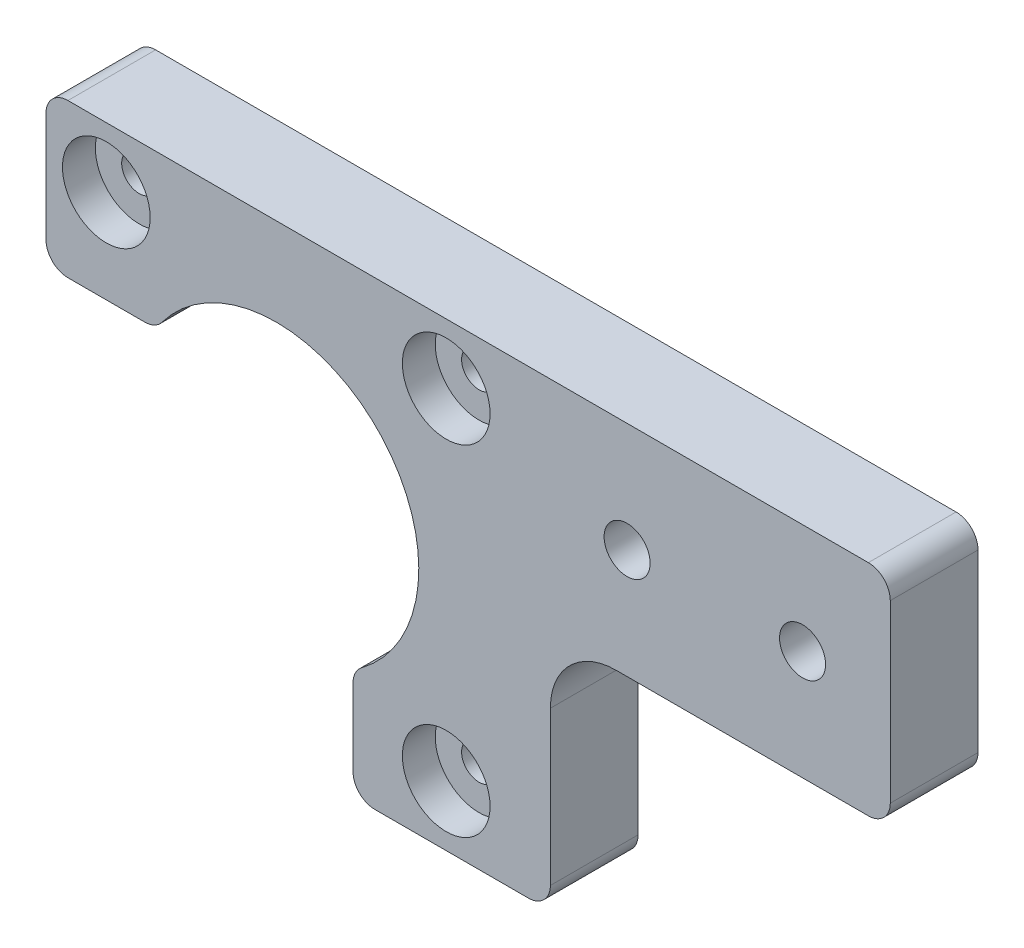
ISO-10303-21;
HEADER;
FILE_DESCRIPTION(('STEP AP214'),'2;1');
FILE_NAME('part.step','',(''),(''),'','','');
FILE_SCHEMA(('AUTOMOTIVE_DESIGN { 1 0 10303 214 1 1 1 1 }'));
ENDSEC;
DATA;
#1=APPLICATION_CONTEXT('core data for automotive mechanical design processes');
#2=APPLICATION_PROTOCOL_DEFINITION('international standard','automotive_design',2000,#1);
#3=PRODUCT_CONTEXT('',#1,'mechanical');
#4=PRODUCT('Part','Part','',(#3));
#5=PRODUCT_RELATED_PRODUCT_CATEGORY('part','',(#4));
#6=PRODUCT_DEFINITION_FORMATION('','',#4);
#7=PRODUCT_DEFINITION_CONTEXT('part definition',#1,'design');
#8=PRODUCT_DEFINITION('design','',#6,#7);
#9=PRODUCT_DEFINITION_SHAPE('','',#8);
#10=(LENGTH_UNIT() NAMED_UNIT(*) SI_UNIT(.MILLI.,.METRE.));
#11=(NAMED_UNIT(*) PLANE_ANGLE_UNIT() SI_UNIT($,.RADIAN.));
#12=(NAMED_UNIT(*) SI_UNIT($,.STERADIAN.) SOLID_ANGLE_UNIT());
#13=UNCERTAINTY_MEASURE_WITH_UNIT(LENGTH_MEASURE(1.E-05),#10,'distance_accuracy_value','');
#14=(GEOMETRIC_REPRESENTATION_CONTEXT(3) GLOBAL_UNCERTAINTY_ASSIGNED_CONTEXT((#13)) GLOBAL_UNIT_ASSIGNED_CONTEXT((#10,
#11,#12)) REPRESENTATION_CONTEXT('',''));
#15=CARTESIAN_POINT('',(0.,0.,0.));
#16=DIRECTION('',(0.,0.,1.));
#17=DIRECTION('',(1.,0.,0.));
#18=AXIS2_PLACEMENT_3D('',#15,#16,#17);
#19=CARTESIAN_POINT('',(0.,0.,8.));
#20=DIRECTION('',(1.,0.,0.));
#21=DIRECTION('',(0.,0.,-1.));
#22=AXIS2_PLACEMENT_3D('',#19,#20,#21);
#23=PLANE('',#22);
#24=DIRECTION('',(0.,-1.,0.));
#25=VECTOR('',#24,1.);
#26=CARTESIAN_POINT('',(0.,0.,8.));
#27=LINE('',#26,#25);
#28=CARTESIAN_POINT('',(0.,40.,8.));
#29=VERTEX_POINT('',#28);
#30=CARTESIAN_POINT('',(0.,30.,8.));
#31=VERTEX_POINT('',#30);
#32=EDGE_CURVE('E249',#29,#31,#27,.T.);
#33=ORIENTED_EDGE('',*,*,#32,.F.);
#34=DIRECTION('',(0.,0.,-1.));
#35=VECTOR('',#34,1.);
#36=CARTESIAN_POINT('',(0.,40.,8.));
#37=LINE('',#36,#35);
#38=CARTESIAN_POINT('',(0.,40.,0.));
#39=VERTEX_POINT('',#38);
#40=EDGE_CURVE('E315',#29,#39,#37,.T.);
#41=ORIENTED_EDGE('',*,*,#40,.T.);
#42=DIRECTION('',(0.,-1.,0.));
#43=VECTOR('',#42,1.);
#44=CARTESIAN_POINT('',(0.,0.,0.));
#45=LINE('',#44,#43);
#46=CARTESIAN_POINT('',(0.,30.,0.));
#47=VERTEX_POINT('',#46);
#48=EDGE_CURVE('E246',#39,#47,#45,.T.);
#49=ORIENTED_EDGE('',*,*,#48,.T.);
#50=DIRECTION('',(0.,0.,1.));
#51=VECTOR('',#50,1.);
#52=CARTESIAN_POINT('',(0.,30.,8.));
#53=LINE('',#52,#51);
#54=EDGE_CURVE('E312',#47,#31,#53,.T.);
#55=ORIENTED_EDGE('',*,*,#54,.T.);
#56=EDGE_LOOP('',(#33,#41,#49,#55));
#57=FACE_BOUND('',#56,.T.);
#58=ADVANCED_FACE('F33',(#57),#23,.F.);
#59=CARTESIAN_POINT('',(0.,0.,8.));
#60=DIRECTION('',(0.,1.,0.));
#61=DIRECTION('',(0.,0.,1.));
#62=AXIS2_PLACEMENT_3D('',#59,#60,#61);
#63=PLANE('',#62);
#64=DIRECTION('',(1.,0.,0.));
#65=VECTOR('',#64,1.);
#66=CARTESIAN_POINT('',(0.,0.,8.));
#67=LINE('',#66,#65);
#68=CARTESIAN_POINT('',(30.,0.,8.));
#69=VERTEX_POINT('',#68);
#70=CARTESIAN_POINT('',(43.9999999999994,0.,8.));
#71=VERTEX_POINT('',#70);
#72=EDGE_CURVE('E252',#69,#71,#67,.T.);
#73=ORIENTED_EDGE('',*,*,#72,.F.);
#74=DIRECTION('',(0.,0.,1.));
#75=VECTOR('',#74,1.);
#76=CARTESIAN_POINT('',(30.,0.,8.));
#77=LINE('',#76,#75);
#78=CARTESIAN_POINT('',(30.,0.,0.));
#79=VERTEX_POINT('',#78);
#80=EDGE_CURVE('E41',#69,#79,#77,.F.);
#81=ORIENTED_EDGE('',*,*,#80,.T.);
#82=DIRECTION('',(1.,0.,0.));
#83=VECTOR('',#82,1.);
#84=CARTESIAN_POINT('',(0.,0.,0.));
#85=LINE('',#84,#83);
#86=CARTESIAN_POINT('',(43.9999999999994,0.,0.));
#87=VERTEX_POINT('',#86);
#88=EDGE_CURVE('E262',#79,#87,#85,.T.);
#89=ORIENTED_EDGE('',*,*,#88,.T.);
#90=DIRECTION('',(0.,0.,1.));
#91=VECTOR('',#90,1.);
#92=CARTESIAN_POINT('',(43.9999999999994,0.,8.));
#93=LINE('',#92,#91);
#94=EDGE_CURVE('E333',#87,#71,#93,.T.);
#95=ORIENTED_EDGE('',*,*,#94,.T.);
#96=EDGE_LOOP('',(#73,#81,#89,#95));
#97=FACE_BOUND('',#96,.T.);
#98=ADVANCED_FACE('F339',(#97),#63,.F.);
#99=CARTESIAN_POINT('',(77.,0.,8.));
#100=DIRECTION('',(-1.,0.,0.));
#101=DIRECTION('',(0.,0.,1.));
#102=AXIS2_PLACEMENT_3D('',#99,#100,#101);
#103=PLANE('',#102);
#104=DIRECTION('',(0.,1.,0.));
#105=VECTOR('',#104,1.);
#106=CARTESIAN_POINT('',(77.,0.,0.));
#107=LINE('',#106,#105);
#108=CARTESIAN_POINT('',(77.,24.,0.));
#109=VERTEX_POINT('',#108);
#110=CARTESIAN_POINT('',(77.,40.,0.));
#111=VERTEX_POINT('',#110);
#112=EDGE_CURVE('E265',#109,#111,#107,.T.);
#113=ORIENTED_EDGE('',*,*,#112,.T.);
#114=DIRECTION('',(0.,0.,-1.));
#115=VECTOR('',#114,1.);
#116=CARTESIAN_POINT('',(77.,40.,8.));
#117=LINE('',#116,#115);
#118=CARTESIAN_POINT('',(77.,40.,8.));
#119=VERTEX_POINT('',#118);
#120=EDGE_CURVE('E324',#111,#119,#117,.F.);
#121=ORIENTED_EDGE('',*,*,#120,.T.);
#122=DIRECTION('',(0.,1.,0.));
#123=VECTOR('',#122,1.);
#124=CARTESIAN_POINT('',(77.,0.,8.));
#125=LINE('',#124,#123);
#126=CARTESIAN_POINT('',(77.,24.,8.));
#127=VERTEX_POINT('',#126);
#128=EDGE_CURVE('E255',#127,#119,#125,.T.);
#129=ORIENTED_EDGE('',*,*,#128,.F.);
#130=DIRECTION('',(0.,0.,1.));
#131=VECTOR('',#130,1.);
#132=CARTESIAN_POINT('',(77.,24.,8.));
#133=LINE('',#132,#131);
#134=EDGE_CURVE('E55',#127,#109,#133,.F.);
#135=ORIENTED_EDGE('',*,*,#134,.T.);
#136=EDGE_LOOP('',(#113,#121,#129,#135));
#137=FACE_BOUND('',#136,.T.);
#138=ADVANCED_FACE('F390',(#137),#103,.F.);
#139=CARTESIAN_POINT('',(0.,42.,8.));
#140=DIRECTION('',(0.,-1.,0.));
#141=DIRECTION('',(0.,0.,-1.));
#142=AXIS2_PLACEMENT_3D('',#139,#140,#141);
#143=PLANE('',#142);
#144=DIRECTION('',(-1.,0.,0.));
#145=VECTOR('',#144,1.);
#146=CARTESIAN_POINT('',(0.,42.,0.));
#147=LINE('',#146,#145);
#148=CARTESIAN_POINT('',(75.,42.,0.));
#149=VERTEX_POINT('',#148);
#150=CARTESIAN_POINT('',(2.,42.,0.));
#151=VERTEX_POINT('',#150);
#152=EDGE_CURVE('E253',#149,#151,#147,.T.);
#153=ORIENTED_EDGE('',*,*,#152,.T.);
#154=DIRECTION('',(0.,0.,-1.));
#155=VECTOR('',#154,1.);
#156=CARTESIAN_POINT('',(2.,42.,8.));
#157=LINE('',#156,#155);
#158=CARTESIAN_POINT('',(2.,42.,8.));
#159=VERTEX_POINT('',#158);
#160=EDGE_CURVE('E321',#151,#159,#157,.F.);
#161=ORIENTED_EDGE('',*,*,#160,.T.);
#162=DIRECTION('',(-1.,0.,0.));
#163=VECTOR('',#162,1.);
#164=CARTESIAN_POINT('',(0.,42.,8.));
#165=LINE('',#164,#163);
#166=CARTESIAN_POINT('',(75.,42.,8.));
#167=VERTEX_POINT('',#166);
#168=EDGE_CURVE('E179',#167,#159,#165,.T.);
#169=ORIENTED_EDGE('',*,*,#168,.F.);
#170=DIRECTION('',(0.,0.,-1.));
#171=VECTOR('',#170,1.);
#172=CARTESIAN_POINT('',(75.,42.,8.));
#173=LINE('',#172,#171);
#174=EDGE_CURVE('E318',#167,#149,#173,.T.);
#175=ORIENTED_EDGE('',*,*,#174,.T.);
#176=EDGE_LOOP('',(#153,#161,#169,#175));
#177=FACE_BOUND('',#176,.T.);
#178=ADVANCED_FACE('F383',(#177),#143,.F.);
#179=CARTESIAN_POINT('',(0.,0.,8.));
#180=DIRECTION('',(0.,0.,-1.));
#181=DIRECTION('',(-1.,0.,0.));
#182=AXIS2_PLACEMENT_3D('',#179,#180,#181);
#183=PLANE('',#182);
#184=CARTESIAN_POINT('',(68.9999999999999,32.,8.));
#185=DIRECTION('',(0.,0.,1.));
#186=DIRECTION('',(1.,0.,0.));
#187=AXIS2_PLACEMENT_3D('',#184,#185,#186);
#188=CIRCLE('',#187,2.10000000000082);
#189=CARTESIAN_POINT('',(71.1000000000008,32.,8.));
#190=VERTEX_POINT('',#189);
#191=EDGE_CURVE('E672',#190,#190,#188,.T.);
#192=ORIENTED_EDGE('',*,*,#191,.F.);
#193=EDGE_LOOP('',(#192));
#194=FACE_BOUND('',#193,.T.);
#195=CARTESIAN_POINT('',(52.9999999999999,32.,8.));
#196=DIRECTION('',(0.,0.,1.));
#197=DIRECTION('',(1.,0.,0.));
#198=AXIS2_PLACEMENT_3D('',#195,#196,#197);
#199=CIRCLE('',#198,2.09999999999897);
#200=CARTESIAN_POINT('',(55.0999999999989,32.,8.));
#201=VERTEX_POINT('',#200);
#202=EDGE_CURVE('E675',#201,#201,#199,.T.);
#203=ORIENTED_EDGE('',*,*,#202,.F.);
#204=EDGE_LOOP('',(#203));
#205=FACE_BOUND('',#204,.T.);
#206=CARTESIAN_POINT('',(21.0000000000008,21.,8.));
#207=DIRECTION('',(0.,0.,1.));
#208=DIRECTION('',(1.,0.,0.));
#209=AXIS2_PLACEMENT_3D('',#206,#207,#208);
#210=CIRCLE('',#209,12.9999999999971);
#211=CARTESIAN_POINT('',(28.7999999999999,10.6000000000029,8.));
#212=VERTEX_POINT('',#211);
#213=CARTESIAN_POINT('',(10.6000000000042,28.7999999999998,8.));
#214=VERTEX_POINT('',#213);
#215=EDGE_CURVE('E220',#212,#214,#210,.T.);
#216=ORIENTED_EDGE('',*,*,#215,.F.);
#217=CARTESIAN_POINT('',(30.,9.00000000000301,8.));
#218=DIRECTION('',(0.,0.,-1.));
#219=DIRECTION('',(-1.,0.,0.));
#220=AXIS2_PLACEMENT_3D('',#217,#218,#219);
#221=CIRCLE('',#220,2.);
#222=CARTESIAN_POINT('',(28.,9.00000000000301,8.));
#223=VERTEX_POINT('',#222);
#224=EDGE_CURVE('E290',#212,#223,#221,.F.);
#225=ORIENTED_EDGE('',*,*,#224,.T.);
#226=DIRECTION('',(0.,1.,0.));
#227=VECTOR('',#226,1.);
#228=CARTESIAN_POINT('',(28.,0.,8.));
#229=LINE('',#228,#227);
#230=CARTESIAN_POINT('',(28.,2.,8.));
#231=VERTEX_POINT('',#230);
#232=EDGE_CURVE('E210',#231,#223,#229,.T.);
#233=ORIENTED_EDGE('',*,*,#232,.F.);
#234=CARTESIAN_POINT('',(30.,2.,8.));
#235=DIRECTION('',(0.,0.,-1.));
#236=DIRECTION('',(-1.,0.,0.));
#237=AXIS2_PLACEMENT_3D('',#234,#235,#236);
#238=CIRCLE('',#237,2.);
#239=EDGE_CURVE('E278',#231,#69,#238,.F.);
#240=ORIENTED_EDGE('',*,*,#239,.T.);
#241=ORIENTED_EDGE('',*,*,#72,.T.);
#242=CARTESIAN_POINT('',(43.9999999999994,2.,8.));
#243=DIRECTION('',(0.,0.,-1.));
#244=DIRECTION('',(-1.,0.,0.));
#245=AXIS2_PLACEMENT_3D('',#242,#243,#244);
#246=CIRCLE('',#245,2.);
#247=CARTESIAN_POINT('',(45.9999999999994,2.,8.));
#248=VERTEX_POINT('',#247);
#249=EDGE_CURVE('E185',#71,#248,#246,.F.);
#250=ORIENTED_EDGE('',*,*,#249,.T.);
#251=DIRECTION('',(0.,-1.,0.));
#252=VECTOR('',#251,1.);
#253=CARTESIAN_POINT('',(45.9999999999994,0.,8.));
#254=LINE('',#253,#252);
#255=CARTESIAN_POINT('',(45.9999999999994,16.,8.));
#256=VERTEX_POINT('',#255);
#257=EDGE_CURVE('E175',#256,#248,#254,.T.);
#258=ORIENTED_EDGE('',*,*,#257,.F.);
#259=CARTESIAN_POINT('',(51.9999999999994,16.,8.));
#260=DIRECTION('',(0.,0.,-1.));
#261=DIRECTION('',(-1.,0.,0.));
#262=AXIS2_PLACEMENT_3D('',#259,#260,#261);
#263=CIRCLE('',#262,6.);
#264=CARTESIAN_POINT('',(51.9999999999994,22.,8.));
#265=VERTEX_POINT('',#264);
#266=EDGE_CURVE('E159',#256,#265,#263,.T.);
#267=ORIENTED_EDGE('',*,*,#266,.T.);
#268=DIRECTION('',(-1.,0.,0.));
#269=VECTOR('',#268,1.);
#270=CARTESIAN_POINT('',(77.,22.,8.));
#271=LINE('',#270,#269);
#272=CARTESIAN_POINT('',(75.,22.,8.));
#273=VERTEX_POINT('',#272);
#274=EDGE_CURVE('E187',#273,#265,#271,.T.);
#275=ORIENTED_EDGE('',*,*,#274,.F.);
#276=CARTESIAN_POINT('',(75.,24.,8.));
#277=DIRECTION('',(0.,0.,-1.));
#278=DIRECTION('',(-1.,0.,0.));
#279=AXIS2_PLACEMENT_3D('',#276,#277,#278);
#280=CIRCLE('',#279,2.);
#281=EDGE_CURVE('E284',#273,#127,#280,.F.);
#282=ORIENTED_EDGE('',*,*,#281,.T.);
#283=ORIENTED_EDGE('',*,*,#128,.T.);
#284=CARTESIAN_POINT('',(75.,40.,8.));
#285=DIRECTION('',(0.,0.,-1.));
#286=DIRECTION('',(-1.,0.,0.));
#287=AXIS2_PLACEMENT_3D('',#284,#285,#286);
#288=CIRCLE('',#287,2.);
#289=EDGE_CURVE('E286',#119,#167,#288,.F.);
#290=ORIENTED_EDGE('',*,*,#289,.T.);
#291=ORIENTED_EDGE('',*,*,#168,.T.);
#292=CARTESIAN_POINT('',(2.,40.,8.));
#293=DIRECTION('',(0.,0.,-1.));
#294=DIRECTION('',(-1.,0.,0.));
#295=AXIS2_PLACEMENT_3D('',#292,#293,#294);
#296=CIRCLE('',#295,2.);
#297=EDGE_CURVE('E288',#159,#29,#296,.F.);
#298=ORIENTED_EDGE('',*,*,#297,.T.);
#299=ORIENTED_EDGE('',*,*,#32,.T.);
#300=CARTESIAN_POINT('',(2.,30.,8.));
#301=DIRECTION('',(0.,0.,-1.));
#302=DIRECTION('',(-1.,0.,0.));
#303=AXIS2_PLACEMENT_3D('',#300,#301,#302);
#304=CIRCLE('',#303,2.);
#305=CARTESIAN_POINT('',(2.,28.,8.));
#306=VERTEX_POINT('',#305);
#307=EDGE_CURVE('E280',#31,#306,#304,.F.);
#308=ORIENTED_EDGE('',*,*,#307,.T.);
#309=DIRECTION('',(-1.,0.,0.));
#310=VECTOR('',#309,1.);
#311=CARTESIAN_POINT('',(0.,28.,8.));
#312=LINE('',#311,#310);
#313=CARTESIAN_POINT('',(9.0000000000044,28.,8.));
#314=VERTEX_POINT('',#313);
#315=EDGE_CURVE('E217',#314,#306,#312,.T.);
#316=ORIENTED_EDGE('',*,*,#315,.F.);
#317=CARTESIAN_POINT('',(9.0000000000044,30.,8.));
#318=DIRECTION('',(0.,0.,-1.));
#319=DIRECTION('',(-1.,0.,0.));
#320=AXIS2_PLACEMENT_3D('',#317,#318,#319);
#321=CIRCLE('',#320,2.);
#322=EDGE_CURVE('E282',#314,#214,#321,.F.);
#323=ORIENTED_EDGE('',*,*,#322,.T.);
#324=EDGE_LOOP('',(#216,#225,#233,#240,#241,#250,#258,#267,#275,#282,#283,#290,#291,#298,#299,
#308,#316,#323));
#325=FACE_BOUND('',#324,.T.);
#326=CARTESIAN_POINT('',(36.5,5.5,8.));
#327=DIRECTION('',(0.,0.,1.));
#328=DIRECTION('',(1.,0.,0.));
#329=AXIS2_PLACEMENT_3D('',#326,#327,#328);
#330=CIRCLE('',#329,4.00000000000359);
#331=CARTESIAN_POINT('',(40.5000000000036,5.5,8.));
#332=VERTEX_POINT('',#331);
#333=EDGE_CURVE('E228',#332,#332,#330,.T.);
#334=ORIENTED_EDGE('',*,*,#333,.F.);
#335=EDGE_LOOP('',(#334));
#336=FACE_BOUND('',#335,.T.);
#337=CARTESIAN_POINT('',(36.5,36.5,8.));
#338=DIRECTION('',(0.,0.,1.));
#339=DIRECTION('',(1.,0.,0.));
#340=AXIS2_PLACEMENT_3D('',#337,#338,#339);
#341=CIRCLE('',#340,4.0000000000036);
#342=CARTESIAN_POINT('',(40.5000000000036,36.5,8.));
#343=VERTEX_POINT('',#342);
#344=EDGE_CURVE('E234',#343,#343,#341,.T.);
#345=ORIENTED_EDGE('',*,*,#344,.F.);
#346=EDGE_LOOP('',(#345));
#347=FACE_BOUND('',#346,.T.);
#348=CARTESIAN_POINT('',(5.49999999999962,36.5,8.));
#349=DIRECTION('',(0.,0.,1.));
#350=DIRECTION('',(1.,0.,0.));
#351=AXIS2_PLACEMENT_3D('',#348,#349,#350);
#352=CIRCLE('',#351,3.99999999999932);
#353=CARTESIAN_POINT('',(9.49999999999894,36.5,8.));
#354=VERTEX_POINT('',#353);
#355=EDGE_CURVE('E240',#354,#354,#352,.T.);
#356=ORIENTED_EDGE('',*,*,#355,.F.);
#357=EDGE_LOOP('',(#356));
#358=FACE_BOUND('',#357,.T.);
#359=ADVANCED_FACE('F182',(#194,#205,#325,#336,#347,#358),#183,.F.);
#360=CARTESIAN_POINT('',(0.,0.,0.));
#361=DIRECTION('',(0.,0.,-1.));
#362=DIRECTION('',(-1.,0.,0.));
#363=AXIS2_PLACEMENT_3D('',#360,#361,#362);
#364=PLANE('',#363);
#365=CARTESIAN_POINT('',(68.9999999999999,32.,0.));
#366=DIRECTION('',(0.,0.,1.));
#367=DIRECTION('',(1.,0.,0.));
#368=AXIS2_PLACEMENT_3D('',#365,#366,#367);
#369=CIRCLE('',#368,2.10000000000082);
#370=CARTESIAN_POINT('',(71.1000000000008,32.,0.));
#371=VERTEX_POINT('',#370);
#372=EDGE_CURVE('E677',#371,#371,#369,.T.);
#373=ORIENTED_EDGE('',*,*,#372,.T.);
#374=EDGE_LOOP('',(#373));
#375=FACE_BOUND('',#374,.T.);
#376=CARTESIAN_POINT('',(52.9999999999999,32.,0.));
#377=DIRECTION('',(0.,0.,1.));
#378=DIRECTION('',(1.,0.,0.));
#379=AXIS2_PLACEMENT_3D('',#376,#377,#378);
#380=CIRCLE('',#379,2.09999999999897);
#381=CARTESIAN_POINT('',(55.0999999999989,32.,0.));
#382=VERTEX_POINT('',#381);
#383=EDGE_CURVE('E190',#382,#382,#380,.T.);
#384=ORIENTED_EDGE('',*,*,#383,.T.);
#385=EDGE_LOOP('',(#384));
#386=FACE_BOUND('',#385,.T.);
#387=DIRECTION('',(0.,1.,0.));
#388=VECTOR('',#387,1.);
#389=CARTESIAN_POINT('',(28.,0.,0.));
#390=LINE('',#389,#388);
#391=CARTESIAN_POINT('',(28.,2.,0.));
#392=VERTEX_POINT('',#391);
#393=CARTESIAN_POINT('',(28.,9.00000000000301,0.));
#394=VERTEX_POINT('',#393);
#395=EDGE_CURVE('E213',#392,#394,#390,.T.);
#396=ORIENTED_EDGE('',*,*,#395,.T.);
#397=CARTESIAN_POINT('',(30.,9.00000000000301,0.));
#398=DIRECTION('',(0.,0.,-1.));
#399=DIRECTION('',(-1.,0.,0.));
#400=AXIS2_PLACEMENT_3D('',#397,#398,#399);
#401=CIRCLE('',#400,2.);
#402=CARTESIAN_POINT('',(28.7999999999999,10.6000000000029,0.));
#403=VERTEX_POINT('',#402);
#404=EDGE_CURVE('E310',#394,#403,#401,.T.);
#405=ORIENTED_EDGE('',*,*,#404,.T.);
#406=CARTESIAN_POINT('',(21.0000000000008,21.,0.));
#407=DIRECTION('',(0.,0.,1.));
#408=DIRECTION('',(1.,0.,0.));
#409=AXIS2_PLACEMENT_3D('',#406,#407,#408);
#410=CIRCLE('',#409,12.9999999999971);
#411=CARTESIAN_POINT('',(10.6000000000042,28.7999999999998,0.));
#412=VERTEX_POINT('',#411);
#413=EDGE_CURVE('E225',#403,#412,#410,.T.);
#414=ORIENTED_EDGE('',*,*,#413,.T.);
#415=CARTESIAN_POINT('',(9.0000000000044,30.,0.));
#416=DIRECTION('',(0.,0.,-1.));
#417=DIRECTION('',(-1.,0.,0.));
#418=AXIS2_PLACEMENT_3D('',#415,#416,#417);
#419=CIRCLE('',#418,2.);
#420=CARTESIAN_POINT('',(9.0000000000044,28.,0.));
#421=VERTEX_POINT('',#420);
#422=EDGE_CURVE('E303',#412,#421,#419,.T.);
#423=ORIENTED_EDGE('',*,*,#422,.T.);
#424=DIRECTION('',(-1.,0.,0.));
#425=VECTOR('',#424,1.);
#426=CARTESIAN_POINT('',(0.,28.,0.));
#427=LINE('',#426,#425);
#428=CARTESIAN_POINT('',(2.,28.,0.));
#429=VERTEX_POINT('',#428);
#430=EDGE_CURVE('E216',#421,#429,#427,.T.);
#431=ORIENTED_EDGE('',*,*,#430,.T.);
#432=CARTESIAN_POINT('',(2.,30.,0.));
#433=DIRECTION('',(0.,0.,-1.));
#434=DIRECTION('',(-1.,0.,0.));
#435=AXIS2_PLACEMENT_3D('',#432,#433,#434);
#436=CIRCLE('',#435,2.);
#437=EDGE_CURVE('E301',#429,#47,#436,.T.);
#438=ORIENTED_EDGE('',*,*,#437,.T.);
#439=ORIENTED_EDGE('',*,*,#48,.F.);
#440=CARTESIAN_POINT('',(2.,40.,0.));
#441=DIRECTION('',(0.,0.,-1.));
#442=DIRECTION('',(-1.,0.,0.));
#443=AXIS2_PLACEMENT_3D('',#440,#441,#442);
#444=CIRCLE('',#443,2.);
#445=EDGE_CURVE('E308',#39,#151,#444,.T.);
#446=ORIENTED_EDGE('',*,*,#445,.T.);
#447=ORIENTED_EDGE('',*,*,#152,.F.);
#448=CARTESIAN_POINT('',(75.,40.,0.));
#449=DIRECTION('',(0.,0.,-1.));
#450=DIRECTION('',(-1.,0.,0.));
#451=AXIS2_PLACEMENT_3D('',#448,#449,#450);
#452=CIRCLE('',#451,2.);
#453=EDGE_CURVE('E48',#149,#111,#452,.T.);
#454=ORIENTED_EDGE('',*,*,#453,.T.);
#455=ORIENTED_EDGE('',*,*,#112,.F.);
#456=CARTESIAN_POINT('',(75.,24.,0.));
#457=DIRECTION('',(0.,0.,-1.));
#458=DIRECTION('',(-1.,0.,0.));
#459=AXIS2_PLACEMENT_3D('',#456,#457,#458);
#460=CIRCLE('',#459,2.);
#461=CARTESIAN_POINT('',(75.,22.,0.));
#462=VERTEX_POINT('',#461);
#463=EDGE_CURVE('E305',#109,#462,#460,.T.);
#464=ORIENTED_EDGE('',*,*,#463,.T.);
#465=DIRECTION('',(-1.,0.,0.));
#466=VECTOR('',#465,1.);
#467=CARTESIAN_POINT('',(77.,22.,0.));
#468=LINE('',#467,#466);
#469=CARTESIAN_POINT('',(51.9999999999994,22.,0.));
#470=VERTEX_POINT('',#469);
#471=EDGE_CURVE('E186',#462,#470,#468,.T.);
#472=ORIENTED_EDGE('',*,*,#471,.T.);
#473=CARTESIAN_POINT('',(51.9999999999994,16.,0.));
#474=DIRECTION('',(0.,0.,-1.));
#475=DIRECTION('',(-1.,0.,0.));
#476=AXIS2_PLACEMENT_3D('',#473,#474,#475);
#477=CIRCLE('',#476,6.);
#478=CARTESIAN_POINT('',(45.9999999999994,16.,0.));
#479=VERTEX_POINT('',#478);
#480=EDGE_CURVE('E169',#470,#479,#477,.F.);
#481=ORIENTED_EDGE('',*,*,#480,.T.);
#482=DIRECTION('',(0.,-1.,0.));
#483=VECTOR('',#482,1.);
#484=CARTESIAN_POINT('',(45.9999999999994,0.,0.));
#485=LINE('',#484,#483);
#486=CARTESIAN_POINT('',(45.9999999999994,2.,0.));
#487=VERTEX_POINT('',#486);
#488=EDGE_CURVE('E178',#479,#487,#485,.T.);
#489=ORIENTED_EDGE('',*,*,#488,.T.);
#490=CARTESIAN_POINT('',(43.9999999999994,2.,0.));
#491=DIRECTION('',(0.,0.,-1.));
#492=DIRECTION('',(-1.,0.,0.));
#493=AXIS2_PLACEMENT_3D('',#490,#491,#492);
#494=CIRCLE('',#493,2.);
#495=EDGE_CURVE('E297',#487,#87,#494,.T.);
#496=ORIENTED_EDGE('',*,*,#495,.T.);
#497=ORIENTED_EDGE('',*,*,#88,.F.);
#498=CARTESIAN_POINT('',(30.,2.,0.));
#499=DIRECTION('',(0.,0.,-1.));
#500=DIRECTION('',(-1.,0.,0.));
#501=AXIS2_PLACEMENT_3D('',#498,#499,#500);
#502=CIRCLE('',#501,2.);
#503=EDGE_CURVE('E299',#79,#392,#502,.T.);
#504=ORIENTED_EDGE('',*,*,#503,.T.);
#505=EDGE_LOOP('',(#396,#405,#414,#423,#431,#438,#439,#446,#447,#454,#455,#464,#472,#481,#489,
#496,#497,#504));
#506=FACE_BOUND('',#505,.T.);
#507=CARTESIAN_POINT('',(36.5,5.5,0.));
#508=DIRECTION('',(0.,0.,1.));
#509=DIRECTION('',(1.,0.,0.));
#510=AXIS2_PLACEMENT_3D('',#507,#508,#509);
#511=CIRCLE('',#510,1.59999999999672);
#512=CARTESIAN_POINT('',(38.0999999999967,5.5,0.));
#513=VERTEX_POINT('',#512);
#514=EDGE_CURVE('E194',#513,#513,#511,.T.);
#515=ORIENTED_EDGE('',*,*,#514,.T.);
#516=EDGE_LOOP('',(#515));
#517=FACE_BOUND('',#516,.T.);
#518=CARTESIAN_POINT('',(36.5,36.5,0.));
#519=DIRECTION('',(0.,0.,1.));
#520=DIRECTION('',(1.,0.,0.));
#521=AXIS2_PLACEMENT_3D('',#518,#519,#520);
#522=CIRCLE('',#521,1.59999999999585);
#523=CARTESIAN_POINT('',(38.0999999999959,36.5,0.));
#524=VERTEX_POINT('',#523);
#525=EDGE_CURVE('E201',#524,#524,#522,.T.);
#526=ORIENTED_EDGE('',*,*,#525,.T.);
#527=EDGE_LOOP('',(#526));
#528=FACE_BOUND('',#527,.T.);
#529=CARTESIAN_POINT('',(5.49999999999962,36.5,0.));
#530=DIRECTION('',(0.,0.,1.));
#531=DIRECTION('',(1.,0.,0.));
#532=AXIS2_PLACEMENT_3D('',#529,#530,#531);
#533=CIRCLE('',#532,1.59999999999906);
#534=CARTESIAN_POINT('',(7.09999999999868,36.5,0.));
#535=VERTEX_POINT('',#534);
#536=EDGE_CURVE('E207',#535,#535,#533,.T.);
#537=ORIENTED_EDGE('',*,*,#536,.T.);
#538=EDGE_LOOP('',(#537));
#539=FACE_BOUND('',#538,.T.);
#540=ADVANCED_FACE('F343',(#375,#386,#506,#517,#528,#539),#364,.T.);
#541=CARTESIAN_POINT('',(5.49999999999962,36.5,5.));
#542=DIRECTION('',(0.,0.,1.));
#543=DIRECTION('',(1.,0.,0.));
#544=AXIS2_PLACEMENT_3D('',#541,#542,#543);
#545=CYLINDRICAL_SURFACE('',#544,3.99999999999932);
#546=CARTESIAN_POINT('',(5.49999999999962,36.5,5.));
#547=DIRECTION('',(0.,0.,1.));
#548=DIRECTION('',(1.,0.,0.));
#549=AXIS2_PLACEMENT_3D('',#546,#547,#548);
#550=CIRCLE('',#549,3.99999999999932);
#551=CARTESIAN_POINT('',(9.49999999999894,36.5,5.));
#552=VERTEX_POINT('',#551);
#553=EDGE_CURVE('E243',#552,#552,#550,.T.);
#554=ORIENTED_EDGE('',*,*,#553,.F.);
#555=EDGE_LOOP('',(#554));
#556=FACE_BOUND('',#555,.T.);
#557=ORIENTED_EDGE('',*,*,#355,.T.);
#558=EDGE_LOOP('',(#557));
#559=FACE_BOUND('',#558,.T.);
#560=ADVANCED_FACE('F596',(#556,#559),#545,.F.);
#561=CARTESIAN_POINT('',(5.49999999999962,36.5,5.));
#562=DIRECTION('',(0.,0.,1.));
#563=DIRECTION('',(1.,0.,0.));
#564=AXIS2_PLACEMENT_3D('',#561,#562,#563);
#565=PLANE('',#564);
#566=CARTESIAN_POINT('',(5.49999999999962,36.5,5.));
#567=DIRECTION('',(0.,0.,1.));
#568=DIRECTION('',(1.,0.,0.));
#569=AXIS2_PLACEMENT_3D('',#566,#567,#568);
#570=CIRCLE('',#569,1.59999999999906);
#571=CARTESIAN_POINT('',(7.09999999999868,36.5,5.));
#572=VERTEX_POINT('',#571);
#573=EDGE_CURVE('E204',#572,#572,#570,.T.);
#574=ORIENTED_EDGE('',*,*,#573,.F.);
#575=EDGE_LOOP('',(#574));
#576=FACE_BOUND('',#575,.T.);
#577=ORIENTED_EDGE('',*,*,#553,.T.);
#578=EDGE_LOOP('',(#577));
#579=FACE_BOUND('',#578,.T.);
#580=ADVANCED_FACE('F587',(#576,#579),#565,.T.);
#581=CARTESIAN_POINT('',(36.5,36.5,5.));
#582=DIRECTION('',(0.,0.,1.));
#583=DIRECTION('',(1.,0.,0.));
#584=AXIS2_PLACEMENT_3D('',#581,#582,#583);
#585=CYLINDRICAL_SURFACE('',#584,4.0000000000036);
#586=CARTESIAN_POINT('',(36.5,36.5,5.));
#587=DIRECTION('',(0.,0.,1.));
#588=DIRECTION('',(1.,0.,0.));
#589=AXIS2_PLACEMENT_3D('',#586,#587,#588);
#590=CIRCLE('',#589,4.0000000000036);
#591=CARTESIAN_POINT('',(40.5000000000036,36.5,5.));
#592=VERTEX_POINT('',#591);
#593=EDGE_CURVE('E237',#592,#592,#590,.T.);
#594=ORIENTED_EDGE('',*,*,#593,.F.);
#595=EDGE_LOOP('',(#594));
#596=FACE_BOUND('',#595,.T.);
#597=ORIENTED_EDGE('',*,*,#344,.T.);
#598=EDGE_LOOP('',(#597));
#599=FACE_BOUND('',#598,.T.);
#600=ADVANCED_FACE('F579',(#596,#599),#585,.F.);
#601=CARTESIAN_POINT('',(36.5,36.5,5.));
#602=DIRECTION('',(0.,0.,1.));
#603=DIRECTION('',(1.,0.,0.));
#604=AXIS2_PLACEMENT_3D('',#601,#602,#603);
#605=PLANE('',#604);
#606=CARTESIAN_POINT('',(36.5,36.5,5.));
#607=DIRECTION('',(0.,0.,1.));
#608=DIRECTION('',(1.,0.,0.));
#609=AXIS2_PLACEMENT_3D('',#606,#607,#608);
#610=CIRCLE('',#609,1.59999999999585);
#611=CARTESIAN_POINT('',(38.0999999999959,36.5,5.));
#612=VERTEX_POINT('',#611);
#613=EDGE_CURVE('E197',#612,#612,#610,.T.);
#614=ORIENTED_EDGE('',*,*,#613,.F.);
#615=EDGE_LOOP('',(#614));
#616=FACE_BOUND('',#615,.T.);
#617=ORIENTED_EDGE('',*,*,#593,.T.);
#618=EDGE_LOOP('',(#617));
#619=FACE_BOUND('',#618,.T.);
#620=ADVANCED_FACE('F569',(#616,#619),#605,.T.);
#621=CARTESIAN_POINT('',(36.5,5.5,5.));
#622=DIRECTION('',(0.,0.,1.));
#623=DIRECTION('',(1.,0.,0.));
#624=AXIS2_PLACEMENT_3D('',#621,#622,#623);
#625=CYLINDRICAL_SURFACE('',#624,4.00000000000359);
#626=CARTESIAN_POINT('',(36.5,5.5,5.));
#627=DIRECTION('',(0.,0.,1.));
#628=DIRECTION('',(1.,0.,0.));
#629=AXIS2_PLACEMENT_3D('',#626,#627,#628);
#630=CIRCLE('',#629,4.00000000000359);
#631=CARTESIAN_POINT('',(40.5000000000036,5.5,5.));
#632=VERTEX_POINT('',#631);
#633=EDGE_CURVE('E231',#632,#632,#630,.T.);
#634=ORIENTED_EDGE('',*,*,#633,.F.);
#635=EDGE_LOOP('',(#634));
#636=FACE_BOUND('',#635,.T.);
#637=ORIENTED_EDGE('',*,*,#333,.T.);
#638=EDGE_LOOP('',(#637));
#639=FACE_BOUND('',#638,.T.);
#640=ADVANCED_FACE('F559',(#636,#639),#625,.F.);
#641=CARTESIAN_POINT('',(36.5,5.5,5.));
#642=DIRECTION('',(0.,0.,1.));
#643=DIRECTION('',(1.,0.,0.));
#644=AXIS2_PLACEMENT_3D('',#641,#642,#643);
#645=PLANE('',#644);
#646=CARTESIAN_POINT('',(36.5,5.5,5.));
#647=DIRECTION('',(0.,0.,1.));
#648=DIRECTION('',(1.,0.,0.));
#649=AXIS2_PLACEMENT_3D('',#646,#647,#648);
#650=CIRCLE('',#649,1.59999999999672);
#651=CARTESIAN_POINT('',(38.0999999999967,5.5,5.));
#652=VERTEX_POINT('',#651);
#653=EDGE_CURVE('E198',#652,#652,#650,.T.);
#654=ORIENTED_EDGE('',*,*,#653,.F.);
#655=EDGE_LOOP('',(#654));
#656=FACE_BOUND('',#655,.T.);
#657=ORIENTED_EDGE('',*,*,#633,.T.);
#658=EDGE_LOOP('',(#657));
#659=FACE_BOUND('',#658,.T.);
#660=ADVANCED_FACE('F551',(#656,#659),#645,.T.);
#661=CARTESIAN_POINT('',(21.0000000000008,21.,0.));
#662=DIRECTION('',(0.,0.,1.));
#663=DIRECTION('',(1.,0.,0.));
#664=AXIS2_PLACEMENT_3D('',#661,#662,#663);
#665=CYLINDRICAL_SURFACE('',#664,12.9999999999971);
#666=ORIENTED_EDGE('',*,*,#413,.F.);
#667=DIRECTION('',(0.,0.,1.));
#668=VECTOR('',#667,1.);
#669=CARTESIAN_POINT('',(28.7999999999999,10.6000000000029,0.));
#670=LINE('',#669,#668);
#671=EDGE_CURVE('E274',#403,#212,#670,.T.);
#672=ORIENTED_EDGE('',*,*,#671,.T.);
#673=ORIENTED_EDGE('',*,*,#215,.T.);
#674=DIRECTION('',(0.,0.,1.));
#675=VECTOR('',#674,1.);
#676=CARTESIAN_POINT('',(10.6000000000042,28.7999999999998,0.));
#677=LINE('',#676,#675);
#678=EDGE_CURVE('E271',#214,#412,#677,.F.);
#679=ORIENTED_EDGE('',*,*,#678,.T.);
#680=EDGE_LOOP('',(#666,#672,#673,#679));
#681=FACE_BOUND('',#680,.T.);
#682=ADVANCED_FACE('F359',(#681),#665,.F.);
#683=CARTESIAN_POINT('',(28.,0.,0.));
#684=DIRECTION('',(1.,0.,0.));
#685=DIRECTION('',(0.,1.,0.));
#686=AXIS2_PLACEMENT_3D('',#683,#684,#685);
#687=PLANE('',#686);
#688=ORIENTED_EDGE('',*,*,#232,.T.);
#689=DIRECTION('',(0.,0.,1.));
#690=VECTOR('',#689,1.);
#691=CARTESIAN_POINT('',(28.,9.00000000000301,0.));
#692=LINE('',#691,#690);
#693=EDGE_CURVE('E295',#223,#394,#692,.F.);
#694=ORIENTED_EDGE('',*,*,#693,.T.);
#695=ORIENTED_EDGE('',*,*,#395,.F.);
#696=DIRECTION('',(0.,0.,1.));
#697=VECTOR('',#696,1.);
#698=CARTESIAN_POINT('',(28.,2.,0.));
#699=LINE('',#698,#697);
#700=EDGE_CURVE('E292',#392,#231,#699,.T.);
#701=ORIENTED_EDGE('',*,*,#700,.T.);
#702=EDGE_LOOP('',(#688,#694,#695,#701));
#703=FACE_BOUND('',#702,.T.);
#704=ADVANCED_FACE('F351',(#703),#687,.F.);
#705=CARTESIAN_POINT('',(0.,28.,0.));
#706=DIRECTION('',(0.,1.,0.));
#707=DIRECTION('',(-1.,0.,0.));
#708=AXIS2_PLACEMENT_3D('',#705,#706,#707);
#709=PLANE('',#708);
#710=ORIENTED_EDGE('',*,*,#430,.F.);
#711=DIRECTION('',(0.,0.,1.));
#712=VECTOR('',#711,1.);
#713=CARTESIAN_POINT('',(9.0000000000044,28.,0.));
#714=LINE('',#713,#712);
#715=EDGE_CURVE('E331',#421,#314,#714,.T.);
#716=ORIENTED_EDGE('',*,*,#715,.T.);
#717=ORIENTED_EDGE('',*,*,#315,.T.);
#718=DIRECTION('',(0.,0.,1.));
#719=VECTOR('',#718,1.);
#720=CARTESIAN_POINT('',(2.,28.,0.));
#721=LINE('',#720,#719);
#722=EDGE_CURVE('E329',#306,#429,#721,.F.);
#723=ORIENTED_EDGE('',*,*,#722,.T.);
#724=EDGE_LOOP('',(#710,#716,#717,#723));
#725=FACE_BOUND('',#724,.T.);
#726=ADVANCED_FACE('F366',(#725),#709,.F.);
#727=CARTESIAN_POINT('',(5.49999999999962,36.5,0.));
#728=DIRECTION('',(0.,0.,1.));
#729=DIRECTION('',(1.,0.,0.));
#730=AXIS2_PLACEMENT_3D('',#727,#728,#729);
#731=CYLINDRICAL_SURFACE('',#730,1.59999999999906);
#732=ORIENTED_EDGE('',*,*,#536,.F.);
#733=EDGE_LOOP('',(#732));
#734=FACE_BOUND('',#733,.T.);
#735=ORIENTED_EDGE('',*,*,#573,.T.);
#736=EDGE_LOOP('',(#735));
#737=FACE_BOUND('',#736,.T.);
#738=ADVANCED_FACE('F520',(#734,#737),#731,.F.);
#739=CARTESIAN_POINT('',(36.5,36.5,0.));
#740=DIRECTION('',(0.,0.,1.));
#741=DIRECTION('',(1.,0.,0.));
#742=AXIS2_PLACEMENT_3D('',#739,#740,#741);
#743=CYLINDRICAL_SURFACE('',#742,1.59999999999585);
#744=ORIENTED_EDGE('',*,*,#525,.F.);
#745=EDGE_LOOP('',(#744));
#746=FACE_BOUND('',#745,.T.);
#747=ORIENTED_EDGE('',*,*,#613,.T.);
#748=EDGE_LOOP('',(#747));
#749=FACE_BOUND('',#748,.T.);
#750=ADVANCED_FACE('F511',(#746,#749),#743,.F.);
#751=CARTESIAN_POINT('',(36.5,5.5,0.));
#752=DIRECTION('',(0.,0.,1.));
#753=DIRECTION('',(1.,0.,0.));
#754=AXIS2_PLACEMENT_3D('',#751,#752,#753);
#755=CYLINDRICAL_SURFACE('',#754,1.59999999999672);
#756=ORIENTED_EDGE('',*,*,#514,.F.);
#757=EDGE_LOOP('',(#756));
#758=FACE_BOUND('',#757,.T.);
#759=ORIENTED_EDGE('',*,*,#653,.T.);
#760=EDGE_LOOP('',(#759));
#761=FACE_BOUND('',#760,.T.);
#762=ADVANCED_FACE('F503',(#758,#761),#755,.F.);
#763=CARTESIAN_POINT('',(45.9999999999994,0.,0.));
#764=DIRECTION('',(-1.,0.,0.));
#765=DIRECTION('',(0.,0.,1.));
#766=AXIS2_PLACEMENT_3D('',#763,#764,#765);
#767=PLANE('',#766);
#768=ORIENTED_EDGE('',*,*,#257,.T.);
#769=DIRECTION('',(0.,0.,1.));
#770=VECTOR('',#769,1.);
#771=CARTESIAN_POINT('',(45.9999999999994,2.,0.));
#772=LINE('',#771,#770);
#773=EDGE_CURVE('E11',#248,#487,#772,.F.);
#774=ORIENTED_EDGE('',*,*,#773,.T.);
#775=ORIENTED_EDGE('',*,*,#488,.F.);
#776=DIRECTION('',(0.,0.,1.));
#777=VECTOR('',#776,1.);
#778=CARTESIAN_POINT('',(45.9999999999994,16.,8.));
#779=LINE('',#778,#777);
#780=EDGE_CURVE('E163',#479,#256,#779,.T.);
#781=ORIENTED_EDGE('',*,*,#780,.T.);
#782=EDGE_LOOP('',(#768,#774,#775,#781));
#783=FACE_BOUND('',#782,.T.);
#784=ADVANCED_FACE('F174',(#783),#767,.F.);
#785=CARTESIAN_POINT('',(77.,22.,0.));
#786=DIRECTION('',(0.,1.,0.));
#787=DIRECTION('',(0.,0.,1.));
#788=AXIS2_PLACEMENT_3D('',#785,#786,#787);
#789=PLANE('',#788);
#790=ORIENTED_EDGE('',*,*,#471,.F.);
#791=DIRECTION('',(0.,0.,1.));
#792=VECTOR('',#791,1.);
#793=CARTESIAN_POINT('',(75.,22.,0.));
#794=LINE('',#793,#792);
#795=EDGE_CURVE('E326',#462,#273,#794,.T.);
#796=ORIENTED_EDGE('',*,*,#795,.T.);
#797=ORIENTED_EDGE('',*,*,#274,.T.);
#798=DIRECTION('',(0.,0.,1.));
#799=VECTOR('',#798,1.);
#800=CARTESIAN_POINT('',(51.9999999999994,22.,0.));
#801=LINE('',#800,#799);
#802=EDGE_CURVE('E165',#265,#470,#801,.F.);
#803=ORIENTED_EDGE('',*,*,#802,.T.);
#804=EDGE_LOOP('',(#790,#796,#797,#803));
#805=FACE_BOUND('',#804,.T.);
#806=ADVANCED_FACE('F397',(#805),#789,.F.);
#807=CARTESIAN_POINT('',(52.9999999999999,32.,0.));
#808=DIRECTION('',(0.,0.,1.));
#809=DIRECTION('',(1.,0.,0.));
#810=AXIS2_PLACEMENT_3D('',#807,#808,#809);
#811=CYLINDRICAL_SURFACE('',#810,2.09999999999897);
#812=ORIENTED_EDGE('',*,*,#383,.F.);
#813=EDGE_LOOP('',(#812));
#814=FACE_BOUND('',#813,.T.);
#815=ORIENTED_EDGE('',*,*,#202,.T.);
#816=EDGE_LOOP('',(#815));
#817=FACE_BOUND('',#816,.T.);
#818=ADVANCED_FACE('F479',(#814,#817),#811,.F.);
#819=CARTESIAN_POINT('',(68.9999999999999,32.,0.));
#820=DIRECTION('',(0.,0.,1.));
#821=DIRECTION('',(1.,0.,0.));
#822=AXIS2_PLACEMENT_3D('',#819,#820,#821);
#823=CYLINDRICAL_SURFACE('',#822,2.10000000000082);
#824=ORIENTED_EDGE('',*,*,#372,.F.);
#825=EDGE_LOOP('',(#824));
#826=FACE_BOUND('',#825,.T.);
#827=ORIENTED_EDGE('',*,*,#191,.T.);
#828=EDGE_LOOP('',(#827));
#829=FACE_BOUND('',#828,.T.);
#830=ADVANCED_FACE('F413',(#826,#829),#823,.F.);
#831=CARTESIAN_POINT('',(51.9999999999994,16.,0.));
#832=DIRECTION('',(0.,0.,-1.));
#833=DIRECTION('',(-1.,0.,0.));
#834=AXIS2_PLACEMENT_3D('',#831,#832,#833);
#835=CYLINDRICAL_SURFACE('',#834,6.);
#836=ORIENTED_EDGE('',*,*,#480,.F.);
#837=ORIENTED_EDGE('',*,*,#802,.F.);
#838=ORIENTED_EDGE('',*,*,#266,.F.);
#839=ORIENTED_EDGE('',*,*,#780,.F.);
#840=EDGE_LOOP('',(#836,#837,#838,#839));
#841=FACE_BOUND('',#840,.T.);
#842=ADVANCED_FACE('F162',(#841),#835,.F.);
#843=CARTESIAN_POINT('',(30.,9.00000000000301,0.));
#844=DIRECTION('',(0.,0.,1.));
#845=DIRECTION('',(1.,0.,0.));
#846=AXIS2_PLACEMENT_3D('',#843,#844,#845);
#847=CYLINDRICAL_SURFACE('',#846,2.);
#848=ORIENTED_EDGE('',*,*,#404,.F.);
#849=ORIENTED_EDGE('',*,*,#693,.F.);
#850=ORIENTED_EDGE('',*,*,#224,.F.);
#851=ORIENTED_EDGE('',*,*,#671,.F.);
#852=EDGE_LOOP('',(#848,#849,#850,#851));
#853=FACE_BOUND('',#852,.T.);
#854=ADVANCED_FACE('F356',(#853),#847,.T.);
#855=CARTESIAN_POINT('',(2.,40.,8.));
#856=DIRECTION('',(0.,0.,-1.));
#857=DIRECTION('',(-1.,0.,0.));
#858=AXIS2_PLACEMENT_3D('',#855,#856,#857);
#859=CYLINDRICAL_SURFACE('',#858,2.);
#860=ORIENTED_EDGE('',*,*,#297,.F.);
#861=ORIENTED_EDGE('',*,*,#160,.F.);
#862=ORIENTED_EDGE('',*,*,#445,.F.);
#863=ORIENTED_EDGE('',*,*,#40,.F.);
#864=EDGE_LOOP('',(#860,#861,#862,#863));
#865=FACE_BOUND('',#864,.T.);
#866=ADVANCED_FACE('F380',(#865),#859,.T.);
#867=CARTESIAN_POINT('',(75.,40.,8.));
#868=DIRECTION('',(0.,0.,-1.));
#869=DIRECTION('',(-1.,0.,0.));
#870=AXIS2_PLACEMENT_3D('',#867,#868,#869);
#871=CYLINDRICAL_SURFACE('',#870,2.);
#872=ORIENTED_EDGE('',*,*,#289,.F.);
#873=ORIENTED_EDGE('',*,*,#120,.F.);
#874=ORIENTED_EDGE('',*,*,#453,.F.);
#875=ORIENTED_EDGE('',*,*,#174,.F.);
#876=EDGE_LOOP('',(#872,#873,#874,#875));
#877=FACE_BOUND('',#876,.T.);
#878=ADVANCED_FACE('F388',(#877),#871,.T.);
#879=CARTESIAN_POINT('',(75.,24.,0.));
#880=DIRECTION('',(0.,0.,1.));
#881=DIRECTION('',(1.,0.,0.));
#882=AXIS2_PLACEMENT_3D('',#879,#880,#881);
#883=CYLINDRICAL_SURFACE('',#882,2.);
#884=ORIENTED_EDGE('',*,*,#463,.F.);
#885=ORIENTED_EDGE('',*,*,#134,.F.);
#886=ORIENTED_EDGE('',*,*,#281,.F.);
#887=ORIENTED_EDGE('',*,*,#795,.F.);
#888=EDGE_LOOP('',(#884,#885,#886,#887));
#889=FACE_BOUND('',#888,.T.);
#890=ADVANCED_FACE('F394',(#889),#883,.T.);
#891=CARTESIAN_POINT('',(9.0000000000044,30.,0.));
#892=DIRECTION('',(0.,0.,1.));
#893=DIRECTION('',(1.,0.,0.));
#894=AXIS2_PLACEMENT_3D('',#891,#892,#893);
#895=CYLINDRICAL_SURFACE('',#894,2.);
#896=ORIENTED_EDGE('',*,*,#322,.F.);
#897=ORIENTED_EDGE('',*,*,#715,.F.);
#898=ORIENTED_EDGE('',*,*,#422,.F.);
#899=ORIENTED_EDGE('',*,*,#678,.F.);
#900=EDGE_LOOP('',(#896,#897,#898,#899));
#901=FACE_BOUND('',#900,.T.);
#902=ADVANCED_FACE('F370',(#901),#895,.T.);
#903=CARTESIAN_POINT('',(2.,30.,8.));
#904=DIRECTION('',(0.,0.,1.));
#905=DIRECTION('',(1.,0.,0.));
#906=AXIS2_PLACEMENT_3D('',#903,#904,#905);
#907=CYLINDRICAL_SURFACE('',#906,2.);
#908=ORIENTED_EDGE('',*,*,#437,.F.);
#909=ORIENTED_EDGE('',*,*,#722,.F.);
#910=ORIENTED_EDGE('',*,*,#307,.F.);
#911=ORIENTED_EDGE('',*,*,#54,.F.);
#912=EDGE_LOOP('',(#908,#909,#910,#911));
#913=FACE_BOUND('',#912,.T.);
#914=ADVANCED_FACE('F372',(#913),#907,.T.);
#915=CARTESIAN_POINT('',(30.,2.,0.));
#916=DIRECTION('',(0.,0.,1.));
#917=DIRECTION('',(1.,0.,0.));
#918=AXIS2_PLACEMENT_3D('',#915,#916,#917);
#919=CYLINDRICAL_SURFACE('',#918,2.);
#920=ORIENTED_EDGE('',*,*,#503,.F.);
#921=ORIENTED_EDGE('',*,*,#80,.F.);
#922=ORIENTED_EDGE('',*,*,#239,.F.);
#923=ORIENTED_EDGE('',*,*,#700,.F.);
#924=EDGE_LOOP('',(#920,#921,#922,#923));
#925=FACE_BOUND('',#924,.T.);
#926=ADVANCED_FACE('F348',(#925),#919,.T.);
#927=CARTESIAN_POINT('',(43.9999999999994,2.,8.));
#928=DIRECTION('',(0.,0.,1.));
#929=DIRECTION('',(1.,0.,0.));
#930=AXIS2_PLACEMENT_3D('',#927,#928,#929);
#931=CYLINDRICAL_SURFACE('',#930,2.);
#932=ORIENTED_EDGE('',*,*,#495,.F.);
#933=ORIENTED_EDGE('',*,*,#773,.F.);
#934=ORIENTED_EDGE('',*,*,#249,.F.);
#935=ORIENTED_EDGE('',*,*,#94,.F.);
#936=EDGE_LOOP('',(#932,#933,#934,#935));
#937=FACE_BOUND('',#936,.T.);
#938=ADVANCED_FACE('F35',(#937),#931,.T.);
#939=CLOSED_SHELL('',(#58,#98,#138,#178,#359,#540,#560,#580,#600,#620,#640,#660,#682,#704,#726,
#738,#750,#762,#784,#806,#818,#830,#842,#854,#866,#878,#890,#902,#914,#926,#938));
#940=MANIFOLD_SOLID_BREP('B2',#939);
#941=ADVANCED_BREP_SHAPE_REPRESENTATION('',(#18,#940),#14);
#942=SHAPE_DEFINITION_REPRESENTATION(#9,#941);
ENDSEC;
END-ISO-10303-21;
